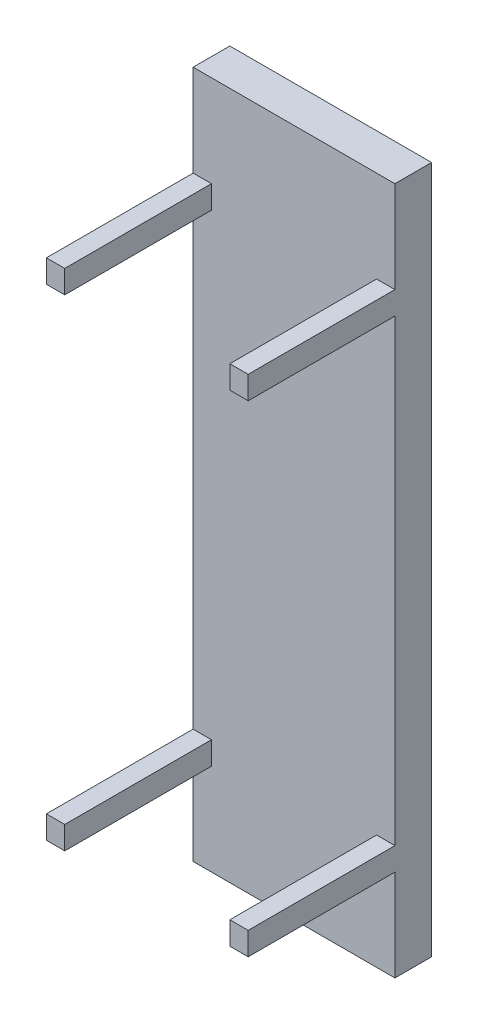
ISO-10303-21;
HEADER;
FILE_DESCRIPTION(('STEP AP214'),'2;1');
FILE_NAME('part.step','',(''),(''),'','','');
FILE_SCHEMA(('AUTOMOTIVE_DESIGN { 1 0 10303 214 1 1 1 1 }'));
ENDSEC;
DATA;
#1=APPLICATION_CONTEXT('core data for automotive mechanical design processes');
#2=APPLICATION_PROTOCOL_DEFINITION('international standard','automotive_design',2000,#1);
#3=PRODUCT_CONTEXT('',#1,'mechanical');
#4=PRODUCT('Part','Part','',(#3));
#5=PRODUCT_RELATED_PRODUCT_CATEGORY('part','',(#4));
#6=PRODUCT_DEFINITION_FORMATION('','',#4);
#7=PRODUCT_DEFINITION_CONTEXT('part definition',#1,'design');
#8=PRODUCT_DEFINITION('design','',#6,#7);
#9=PRODUCT_DEFINITION_SHAPE('','',#8);
#10=(LENGTH_UNIT() NAMED_UNIT(*) SI_UNIT(.MILLI.,.METRE.));
#11=(NAMED_UNIT(*) PLANE_ANGLE_UNIT() SI_UNIT($,.RADIAN.));
#12=(NAMED_UNIT(*) SI_UNIT($,.STERADIAN.) SOLID_ANGLE_UNIT());
#13=UNCERTAINTY_MEASURE_WITH_UNIT(LENGTH_MEASURE(1.E-05),#10,'distance_accuracy_value','');
#14=(GEOMETRIC_REPRESENTATION_CONTEXT(3) GLOBAL_UNCERTAINTY_ASSIGNED_CONTEXT((#13)) GLOBAL_UNIT_ASSIGNED_CONTEXT((#10,
#11,#12)) REPRESENTATION_CONTEXT('',''));
#15=CARTESIAN_POINT('',(0.,0.,0.));
#16=DIRECTION('',(0.,0.,1.));
#17=DIRECTION('',(1.,0.,0.));
#18=AXIS2_PLACEMENT_3D('',#15,#16,#17);
#19=CARTESIAN_POINT('',(0.,0.,80.));
#20=DIRECTION('',(0.,0.,1.));
#21=DIRECTION('',(1.,0.,0.));
#22=AXIS2_PLACEMENT_3D('',#19,#20,#21);
#23=PLANE('',#22);
#24=DIRECTION('',(0.,1.,0.));
#25=VECTOR('',#24,1.);
#26=CARTESIAN_POINT('',(220.,-750.,80.));
#27=LINE('',#26,#25);
#28=CARTESIAN_POINT('',(220.000000000001,-500.,80.));
#29=VERTEX_POINT('',#28);
#30=CARTESIAN_POINT('',(220.,500.,80.));
#31=VERTEX_POINT('',#30);
#32=EDGE_CURVE('E292',#29,#31,#27,.T.);
#33=ORIENTED_EDGE('',*,*,#32,.T.);
#34=DIRECTION('',(1.,0.,0.));
#35=VECTOR('',#34,1.);
#36=CARTESIAN_POINT('',(180.,500.,80.));
#37=LINE('',#36,#35);
#38=CARTESIAN_POINT('',(180.,500.,80.));
#39=VERTEX_POINT('',#38);
#40=EDGE_CURVE('E53',#39,#31,#37,.T.);
#41=ORIENTED_EDGE('',*,*,#40,.F.);
#42=DIRECTION('',(0.,-1.,0.));
#43=VECTOR('',#42,1.);
#44=CARTESIAN_POINT('',(180.,550.,80.));
#45=LINE('',#44,#43);
#46=CARTESIAN_POINT('',(180.,550.,80.));
#47=VERTEX_POINT('',#46);
#48=EDGE_CURVE('E48',#47,#39,#45,.T.);
#49=ORIENTED_EDGE('',*,*,#48,.F.);
#50=DIRECTION('',(-1.,0.,0.));
#51=VECTOR('',#50,1.);
#52=CARTESIAN_POINT('',(220.,550.,80.));
#53=LINE('',#52,#51);
#54=CARTESIAN_POINT('',(220.,550.,80.));
#55=VERTEX_POINT('',#54);
#56=EDGE_CURVE('E558',#55,#47,#53,.T.);
#57=ORIENTED_EDGE('',*,*,#56,.F.);
#58=CARTESIAN_POINT('',(220.,750.,80.));
#59=VERTEX_POINT('',#58);
#60=EDGE_CURVE('E288',#55,#59,#27,.T.);
#61=ORIENTED_EDGE('',*,*,#60,.T.);
#62=DIRECTION('',(-1.,0.,0.));
#63=VECTOR('',#62,1.);
#64=CARTESIAN_POINT('',(-220.,750.,80.));
#65=LINE('',#64,#63);
#66=CARTESIAN_POINT('',(-220.,750.,80.));
#67=VERTEX_POINT('',#66);
#68=EDGE_CURVE('E291',#59,#67,#65,.T.);
#69=ORIENTED_EDGE('',*,*,#68,.T.);
#70=DIRECTION('',(0.,-1.,0.));
#71=VECTOR('',#70,1.);
#72=CARTESIAN_POINT('',(-220.,750.,80.));
#73=LINE('',#72,#71);
#74=CARTESIAN_POINT('',(-220.,550.,80.));
#75=VERTEX_POINT('',#74);
#76=EDGE_CURVE('E282',#67,#75,#73,.T.);
#77=ORIENTED_EDGE('',*,*,#76,.T.);
#78=DIRECTION('',(-1.,0.,0.));
#79=VECTOR('',#78,1.);
#80=CARTESIAN_POINT('',(-220.,550.,80.));
#81=LINE('',#80,#79);
#82=CARTESIAN_POINT('',(-180.,550.,80.));
#83=VERTEX_POINT('',#82);
#84=EDGE_CURVE('E256',#83,#75,#81,.T.);
#85=ORIENTED_EDGE('',*,*,#84,.F.);
#86=DIRECTION('',(0.,1.,0.));
#87=VECTOR('',#86,1.);
#88=CARTESIAN_POINT('',(-180.,550.,80.));
#89=LINE('',#88,#87);
#90=CARTESIAN_POINT('',(-180.,500.,80.));
#91=VERTEX_POINT('',#90);
#92=EDGE_CURVE('E265',#91,#83,#89,.T.);
#93=ORIENTED_EDGE('',*,*,#92,.F.);
#94=DIRECTION('',(1.,0.,0.));
#95=VECTOR('',#94,1.);
#96=CARTESIAN_POINT('',(-180.,500.,80.));
#97=LINE('',#96,#95);
#98=CARTESIAN_POINT('',(-220.,500.,80.));
#99=VERTEX_POINT('',#98);
#100=EDGE_CURVE('E251',#99,#91,#97,.T.);
#101=ORIENTED_EDGE('',*,*,#100,.F.);
#102=CARTESIAN_POINT('',(-220.,-500.,80.));
#103=VERTEX_POINT('',#102);
#104=EDGE_CURVE('E285',#99,#103,#73,.T.);
#105=ORIENTED_EDGE('',*,*,#104,.T.);
#106=DIRECTION('',(-1.,0.,0.));
#107=VECTOR('',#106,1.);
#108=CARTESIAN_POINT('',(-180.,-500.,80.));
#109=LINE('',#108,#107);
#110=CARTESIAN_POINT('',(-180.,-500.,80.));
#111=VERTEX_POINT('',#110);
#112=EDGE_CURVE('E225',#111,#103,#109,.T.);
#113=ORIENTED_EDGE('',*,*,#112,.F.);
#114=DIRECTION('',(0.,1.,0.));
#115=VECTOR('',#114,1.);
#116=CARTESIAN_POINT('',(-180.,-550.,80.));
#117=LINE('',#116,#115);
#118=CARTESIAN_POINT('',(-180.,-550.,80.));
#119=VERTEX_POINT('',#118);
#120=EDGE_CURVE('E230',#119,#111,#117,.T.);
#121=ORIENTED_EDGE('',*,*,#120,.F.);
#122=DIRECTION('',(1.,0.,0.));
#123=VECTOR('',#122,1.);
#124=CARTESIAN_POINT('',(-220.,-550.,80.));
#125=LINE('',#124,#123);
#126=CARTESIAN_POINT('',(-220.,-550.,80.));
#127=VERTEX_POINT('',#126);
#128=EDGE_CURVE('E239',#127,#119,#125,.T.);
#129=ORIENTED_EDGE('',*,*,#128,.F.);
#130=CARTESIAN_POINT('',(-220.,-750.,80.));
#131=VERTEX_POINT('',#130);
#132=EDGE_CURVE('E286',#127,#131,#73,.T.);
#133=ORIENTED_EDGE('',*,*,#132,.T.);
#134=DIRECTION('',(1.,0.,0.));
#135=VECTOR('',#134,1.);
#136=CARTESIAN_POINT('',(-220.,-750.,80.));
#137=LINE('',#136,#135);
#138=CARTESIAN_POINT('',(220.,-750.,80.));
#139=VERTEX_POINT('',#138);
#140=EDGE_CURVE('E284',#131,#139,#137,.T.);
#141=ORIENTED_EDGE('',*,*,#140,.T.);
#142=CARTESIAN_POINT('',(220.,-550.,80.));
#143=VERTEX_POINT('',#142);
#144=EDGE_CURVE('E289',#139,#143,#27,.T.);
#145=ORIENTED_EDGE('',*,*,#144,.T.);
#146=DIRECTION('',(1.,0.,0.));
#147=VECTOR('',#146,1.);
#148=CARTESIAN_POINT('',(220.000000000001,-550.,80.));
#149=LINE('',#148,#147);
#150=CARTESIAN_POINT('',(180.000000000001,-550.,80.));
#151=VERTEX_POINT('',#150);
#152=EDGE_CURVE('E203',#151,#143,#149,.T.);
#153=ORIENTED_EDGE('',*,*,#152,.F.);
#154=DIRECTION('',(0.,-1.,0.));
#155=VECTOR('',#154,1.);
#156=CARTESIAN_POINT('',(180.000000000001,-550.,80.));
#157=LINE('',#156,#155);
#158=CARTESIAN_POINT('',(180.000000000001,-500.,80.));
#159=VERTEX_POINT('',#158);
#160=EDGE_CURVE('E193',#159,#151,#157,.T.);
#161=ORIENTED_EDGE('',*,*,#160,.F.);
#162=DIRECTION('',(-1.,0.,0.));
#163=VECTOR('',#162,1.);
#164=CARTESIAN_POINT('',(180.000000000001,-500.,80.));
#165=LINE('',#164,#163);
#166=EDGE_CURVE('E190',#29,#159,#165,.T.);
#167=ORIENTED_EDGE('',*,*,#166,.F.);
#168=EDGE_LOOP('',(#33,#41,#49,#57,#61,#69,#77,#85,#93,#101,#105,#113,#121,#129,#133,#141,#145,
#153,#161,#167));
#169=FACE_BOUND('',#168,.T.);
#170=ADVANCED_FACE('F33',(#169),#23,.T.);
#171=CARTESIAN_POINT('',(-220.,750.,80.));
#172=DIRECTION('',(1.,0.,0.));
#173=DIRECTION('',(0.,1.,0.));
#174=AXIS2_PLACEMENT_3D('',#171,#172,#173);
#175=PLANE('',#174);
#176=DIRECTION('',(0.,-1.,0.));
#177=VECTOR('',#176,1.);
#178=CARTESIAN_POINT('',(-220.,750.,0.));
#179=LINE('',#178,#177);
#180=CARTESIAN_POINT('',(-220.,750.,0.));
#181=VERTEX_POINT('',#180);
#182=CARTESIAN_POINT('',(-220.,-750.,0.));
#183=VERTEX_POINT('',#182);
#184=EDGE_CURVE('E281',#181,#183,#179,.T.);
#185=ORIENTED_EDGE('',*,*,#184,.T.);
#186=DIRECTION('',(0.,0.,-1.));
#187=VECTOR('',#186,1.);
#188=CARTESIAN_POINT('',(-220.,-750.,80.));
#189=LINE('',#188,#187);
#190=EDGE_CURVE('E11',#131,#183,#189,.T.);
#191=ORIENTED_EDGE('',*,*,#190,.F.);
#192=ORIENTED_EDGE('',*,*,#132,.F.);
#193=DIRECTION('',(0.,0.,-1.));
#194=VECTOR('',#193,1.);
#195=CARTESIAN_POINT('',(-220.,-550.,400.));
#196=LINE('',#195,#194);
#197=CARTESIAN_POINT('',(-220.,-550.,400.));
#198=VERTEX_POINT('',#197);
#199=EDGE_CURVE('E247',#198,#127,#196,.T.);
#200=ORIENTED_EDGE('',*,*,#199,.F.);
#201=DIRECTION('',(0.,-1.,0.));
#202=VECTOR('',#201,1.);
#203=CARTESIAN_POINT('',(-220.,-500.,400.));
#204=LINE('',#203,#202);
#205=CARTESIAN_POINT('',(-220.,-500.,400.));
#206=VERTEX_POINT('',#205);
#207=EDGE_CURVE('E229',#206,#198,#204,.T.);
#208=ORIENTED_EDGE('',*,*,#207,.F.);
#209=DIRECTION('',(0.,0.,-1.));
#210=VECTOR('',#209,1.);
#211=CARTESIAN_POINT('',(-220.,-500.,400.));
#212=LINE('',#211,#210);
#213=EDGE_CURVE('E249',#206,#103,#212,.T.);
#214=ORIENTED_EDGE('',*,*,#213,.T.);
#215=ORIENTED_EDGE('',*,*,#104,.F.);
#216=DIRECTION('',(0.,0.,-1.));
#217=VECTOR('',#216,1.);
#218=CARTESIAN_POINT('',(-220.,500.,400.));
#219=LINE('',#218,#217);
#220=CARTESIAN_POINT('',(-220.,500.,400.));
#221=VERTEX_POINT('',#220);
#222=EDGE_CURVE('E278',#221,#99,#219,.T.);
#223=ORIENTED_EDGE('',*,*,#222,.F.);
#224=DIRECTION('',(0.,-1.,0.));
#225=VECTOR('',#224,1.);
#226=CARTESIAN_POINT('',(-220.,500.,400.));
#227=LINE('',#226,#225);
#228=CARTESIAN_POINT('',(-220.,550.,400.));
#229=VERTEX_POINT('',#228);
#230=EDGE_CURVE('E252',#229,#221,#227,.T.);
#231=ORIENTED_EDGE('',*,*,#230,.F.);
#232=DIRECTION('',(0.,0.,-1.));
#233=VECTOR('',#232,1.);
#234=CARTESIAN_POINT('',(-220.,550.,400.));
#235=LINE('',#234,#233);
#236=EDGE_CURVE('E262',#229,#75,#235,.T.);
#237=ORIENTED_EDGE('',*,*,#236,.T.);
#238=ORIENTED_EDGE('',*,*,#76,.F.);
#239=DIRECTION('',(0.,0.,-1.));
#240=VECTOR('',#239,1.);
#241=CARTESIAN_POINT('',(-220.,750.,80.));
#242=LINE('',#241,#240);
#243=EDGE_CURVE('E294',#67,#181,#242,.T.);
#244=ORIENTED_EDGE('',*,*,#243,.T.);
#245=EDGE_LOOP('',(#185,#191,#192,#200,#208,#214,#215,#223,#231,#237,#238,#244));
#246=FACE_BOUND('',#245,.T.);
#247=ADVANCED_FACE('F35',(#246),#175,.F.);
#248=CARTESIAN_POINT('',(-220.,-750.,80.));
#249=DIRECTION('',(0.,1.,0.));
#250=DIRECTION('',(0.,0.,1.));
#251=AXIS2_PLACEMENT_3D('',#248,#249,#250);
#252=PLANE('',#251);
#253=DIRECTION('',(1.,0.,0.));
#254=VECTOR('',#253,1.);
#255=CARTESIAN_POINT('',(-220.,-750.,0.));
#256=LINE('',#255,#254);
#257=CARTESIAN_POINT('',(220.,-750.,0.));
#258=VERTEX_POINT('',#257);
#259=EDGE_CURVE('E297',#183,#258,#256,.T.);
#260=ORIENTED_EDGE('',*,*,#259,.T.);
#261=DIRECTION('',(0.,0.,-1.));
#262=VECTOR('',#261,1.);
#263=CARTESIAN_POINT('',(220.,-750.,80.));
#264=LINE('',#263,#262);
#265=EDGE_CURVE('E41',#139,#258,#264,.T.);
#266=ORIENTED_EDGE('',*,*,#265,.F.);
#267=ORIENTED_EDGE('',*,*,#140,.F.);
#268=ORIENTED_EDGE('',*,*,#190,.T.);
#269=EDGE_LOOP('',(#260,#266,#267,#268));
#270=FACE_BOUND('',#269,.T.);
#271=ADVANCED_FACE('F346',(#270),#252,.F.);
#272=CARTESIAN_POINT('',(220.,-750.,80.));
#273=DIRECTION('',(-1.,0.,0.));
#274=DIRECTION('',(0.,0.,1.));
#275=AXIS2_PLACEMENT_3D('',#272,#273,#274);
#276=PLANE('',#275);
#277=DIRECTION('',(0.,1.,0.));
#278=VECTOR('',#277,1.);
#279=CARTESIAN_POINT('',(220.,-750.,0.));
#280=LINE('',#279,#278);
#281=CARTESIAN_POINT('',(220.,750.,0.));
#282=VERTEX_POINT('',#281);
#283=EDGE_CURVE('E299',#258,#282,#280,.T.);
#284=ORIENTED_EDGE('',*,*,#283,.T.);
#285=DIRECTION('',(0.,0.,-1.));
#286=VECTOR('',#285,1.);
#287=CARTESIAN_POINT('',(220.,750.,80.));
#288=LINE('',#287,#286);
#289=EDGE_CURVE('E305',#59,#282,#288,.T.);
#290=ORIENTED_EDGE('',*,*,#289,.F.);
#291=ORIENTED_EDGE('',*,*,#60,.F.);
#292=DIRECTION('',(0.,0.,-1.));
#293=VECTOR('',#292,1.);
#294=CARTESIAN_POINT('',(220.,550.,400.));
#295=LINE('',#294,#293);
#296=CARTESIAN_POINT('',(220.,550.,400.));
#297=VERTEX_POINT('',#296);
#298=EDGE_CURVE('E175',#297,#55,#295,.T.);
#299=ORIENTED_EDGE('',*,*,#298,.F.);
#300=DIRECTION('',(0.,1.,0.));
#301=VECTOR('',#300,1.);
#302=CARTESIAN_POINT('',(220.,500.,400.));
#303=LINE('',#302,#301);
#304=CARTESIAN_POINT('',(220.,500.,400.));
#305=VERTEX_POINT('',#304);
#306=EDGE_CURVE('E169',#305,#297,#303,.T.);
#307=ORIENTED_EDGE('',*,*,#306,.F.);
#308=DIRECTION('',(0.,0.,-1.));
#309=VECTOR('',#308,1.);
#310=CARTESIAN_POINT('',(220.,500.,400.));
#311=LINE('',#310,#309);
#312=EDGE_CURVE('E173',#305,#31,#311,.T.);
#313=ORIENTED_EDGE('',*,*,#312,.T.);
#314=ORIENTED_EDGE('',*,*,#32,.F.);
#315=DIRECTION('',(0.,0.,-1.));
#316=VECTOR('',#315,1.);
#317=CARTESIAN_POINT('',(220.000000000001,-500.,400.));
#318=LINE('',#317,#316);
#319=CARTESIAN_POINT('',(220.000000000001,-500.,400.));
#320=VERTEX_POINT('',#319);
#321=EDGE_CURVE('E222',#320,#29,#318,.T.);
#322=ORIENTED_EDGE('',*,*,#321,.F.);
#323=DIRECTION('',(0.,1.,0.));
#324=VECTOR('',#323,1.);
#325=CARTESIAN_POINT('',(220.000000000001,-500.,400.));
#326=LINE('',#325,#324);
#327=CARTESIAN_POINT('',(220.000000000001,-550.,400.));
#328=VERTEX_POINT('',#327);
#329=EDGE_CURVE('E199',#328,#320,#326,.T.);
#330=ORIENTED_EDGE('',*,*,#329,.F.);
#331=DIRECTION('',(0.,0.,-1.));
#332=VECTOR('',#331,1.);
#333=CARTESIAN_POINT('',(220.000000000001,-550.,400.));
#334=LINE('',#333,#332);
#335=EDGE_CURVE('E208',#328,#143,#334,.T.);
#336=ORIENTED_EDGE('',*,*,#335,.T.);
#337=ORIENTED_EDGE('',*,*,#144,.F.);
#338=ORIENTED_EDGE('',*,*,#265,.T.);
#339=EDGE_LOOP('',(#284,#290,#291,#299,#307,#313,#314,#322,#330,#336,#337,#338));
#340=FACE_BOUND('',#339,.T.);
#341=ADVANCED_FACE('F171',(#340),#276,.F.);
#342=CARTESIAN_POINT('',(-220.,750.,80.));
#343=DIRECTION('',(0.,-1.,0.));
#344=DIRECTION('',(0.,0.,-1.));
#345=AXIS2_PLACEMENT_3D('',#342,#343,#344);
#346=PLANE('',#345);
#347=DIRECTION('',(-1.,0.,0.));
#348=VECTOR('',#347,1.);
#349=CARTESIAN_POINT('',(-220.,750.,0.));
#350=LINE('',#349,#348);
#351=EDGE_CURVE('E301',#282,#181,#350,.T.);
#352=ORIENTED_EDGE('',*,*,#351,.T.);
#353=ORIENTED_EDGE('',*,*,#243,.F.);
#354=ORIENTED_EDGE('',*,*,#68,.F.);
#355=ORIENTED_EDGE('',*,*,#289,.T.);
#356=EDGE_LOOP('',(#352,#353,#354,#355));
#357=FACE_BOUND('',#356,.T.);
#358=ADVANCED_FACE('F320',(#357),#346,.F.);
#359=CARTESIAN_POINT('',(0.,0.,0.));
#360=DIRECTION('',(0.,0.,1.));
#361=DIRECTION('',(1.,0.,0.));
#362=AXIS2_PLACEMENT_3D('',#359,#360,#361);
#363=PLANE('',#362);
#364=ORIENTED_EDGE('',*,*,#184,.F.);
#365=ORIENTED_EDGE('',*,*,#351,.F.);
#366=ORIENTED_EDGE('',*,*,#283,.F.);
#367=ORIENTED_EDGE('',*,*,#259,.F.);
#368=EDGE_LOOP('',(#364,#365,#366,#367));
#369=FACE_BOUND('',#368,.T.);
#370=ADVANCED_FACE('F317',(#369),#363,.F.);
#371=CARTESIAN_POINT('',(-180.,500.,400.));
#372=DIRECTION('',(0.,1.,0.));
#373=DIRECTION('',(0.,0.,1.));
#374=AXIS2_PLACEMENT_3D('',#371,#372,#373);
#375=PLANE('',#374);
#376=ORIENTED_EDGE('',*,*,#100,.T.);
#377=DIRECTION('',(0.,0.,-1.));
#378=VECTOR('',#377,1.);
#379=CARTESIAN_POINT('',(-180.,500.,400.));
#380=LINE('',#379,#378);
#381=CARTESIAN_POINT('',(-180.,500.,400.));
#382=VERTEX_POINT('',#381);
#383=EDGE_CURVE('E275',#382,#91,#380,.T.);
#384=ORIENTED_EDGE('',*,*,#383,.F.);
#385=DIRECTION('',(1.,0.,0.));
#386=VECTOR('',#385,1.);
#387=CARTESIAN_POINT('',(-180.,500.,400.));
#388=LINE('',#387,#386);
#389=EDGE_CURVE('E255',#221,#382,#388,.T.);
#390=ORIENTED_EDGE('',*,*,#389,.F.);
#391=ORIENTED_EDGE('',*,*,#222,.T.);
#392=EDGE_LOOP('',(#376,#384,#390,#391));
#393=FACE_BOUND('',#392,.T.);
#394=ADVANCED_FACE('F338',(#393),#375,.F.);
#395=CARTESIAN_POINT('',(-180.,550.,400.));
#396=DIRECTION('',(-1.,0.,0.));
#397=DIRECTION('',(0.,0.,1.));
#398=AXIS2_PLACEMENT_3D('',#395,#396,#397);
#399=PLANE('',#398);
#400=ORIENTED_EDGE('',*,*,#92,.T.);
#401=DIRECTION('',(0.,0.,-1.));
#402=VECTOR('',#401,1.);
#403=CARTESIAN_POINT('',(-180.,550.,400.));
#404=LINE('',#403,#402);
#405=CARTESIAN_POINT('',(-180.,550.,400.));
#406=VERTEX_POINT('',#405);
#407=EDGE_CURVE('E272',#406,#83,#404,.T.);
#408=ORIENTED_EDGE('',*,*,#407,.F.);
#409=DIRECTION('',(0.,1.,0.));
#410=VECTOR('',#409,1.);
#411=CARTESIAN_POINT('',(-180.,550.,400.));
#412=LINE('',#411,#410);
#413=EDGE_CURVE('E258',#382,#406,#412,.T.);
#414=ORIENTED_EDGE('',*,*,#413,.F.);
#415=ORIENTED_EDGE('',*,*,#383,.T.);
#416=EDGE_LOOP('',(#400,#408,#414,#415));
#417=FACE_BOUND('',#416,.T.);
#418=ADVANCED_FACE('F333',(#417),#399,.F.);
#419=CARTESIAN_POINT('',(-220.,550.,400.));
#420=DIRECTION('',(0.,-1.,0.));
#421=DIRECTION('',(0.,0.,-1.));
#422=AXIS2_PLACEMENT_3D('',#419,#420,#421);
#423=PLANE('',#422);
#424=ORIENTED_EDGE('',*,*,#84,.T.);
#425=ORIENTED_EDGE('',*,*,#236,.F.);
#426=DIRECTION('',(-1.,0.,0.));
#427=VECTOR('',#426,1.);
#428=CARTESIAN_POINT('',(-220.,550.,400.));
#429=LINE('',#428,#427);
#430=EDGE_CURVE('E260',#406,#229,#429,.T.);
#431=ORIENTED_EDGE('',*,*,#430,.F.);
#432=ORIENTED_EDGE('',*,*,#407,.T.);
#433=EDGE_LOOP('',(#424,#425,#431,#432));
#434=FACE_BOUND('',#433,.T.);
#435=ADVANCED_FACE('F328',(#434),#423,.F.);
#436=CARTESIAN_POINT('',(0.,0.,400.));
#437=DIRECTION('',(0.,0.,-1.));
#438=DIRECTION('',(-1.,0.,0.));
#439=AXIS2_PLACEMENT_3D('',#436,#437,#438);
#440=PLANE('',#439);
#441=ORIENTED_EDGE('',*,*,#230,.T.);
#442=ORIENTED_EDGE('',*,*,#389,.T.);
#443=ORIENTED_EDGE('',*,*,#413,.T.);
#444=ORIENTED_EDGE('',*,*,#430,.T.);
#445=EDGE_LOOP('',(#441,#442,#443,#444));
#446=FACE_BOUND('',#445,.T.);
#447=ADVANCED_FACE('F387',(#446),#440,.F.);
#448=CARTESIAN_POINT('',(-180.,-500.,400.));
#449=DIRECTION('',(0.,-1.,0.));
#450=DIRECTION('',(0.,0.,-1.));
#451=AXIS2_PLACEMENT_3D('',#448,#449,#450);
#452=PLANE('',#451);
#453=ORIENTED_EDGE('',*,*,#112,.T.);
#454=ORIENTED_EDGE('',*,*,#213,.F.);
#455=DIRECTION('',(-1.,0.,0.));
#456=VECTOR('',#455,1.);
#457=CARTESIAN_POINT('',(-180.,-500.,400.));
#458=LINE('',#457,#456);
#459=CARTESIAN_POINT('',(-180.,-500.,400.));
#460=VERTEX_POINT('',#459);
#461=EDGE_CURVE('E226',#460,#206,#458,.T.);
#462=ORIENTED_EDGE('',*,*,#461,.F.);
#463=DIRECTION('',(0.,0.,-1.));
#464=VECTOR('',#463,1.);
#465=CARTESIAN_POINT('',(-180.,-500.,400.));
#466=LINE('',#465,#464);
#467=EDGE_CURVE('E236',#460,#111,#466,.T.);
#468=ORIENTED_EDGE('',*,*,#467,.T.);
#469=EDGE_LOOP('',(#453,#454,#462,#468));
#470=FACE_BOUND('',#469,.T.);
#471=ADVANCED_FACE('F394',(#470),#452,.F.);
#472=CARTESIAN_POINT('',(-220.,-550.,400.));
#473=DIRECTION('',(0.,1.,0.));
#474=DIRECTION('',(0.,0.,1.));
#475=AXIS2_PLACEMENT_3D('',#472,#473,#474);
#476=PLANE('',#475);
#477=ORIENTED_EDGE('',*,*,#128,.T.);
#478=DIRECTION('',(0.,0.,-1.));
#479=VECTOR('',#478,1.);
#480=CARTESIAN_POINT('',(-180.,-550.,400.));
#481=LINE('',#480,#479);
#482=CARTESIAN_POINT('',(-180.,-550.,400.));
#483=VERTEX_POINT('',#482);
#484=EDGE_CURVE('E245',#483,#119,#481,.T.);
#485=ORIENTED_EDGE('',*,*,#484,.F.);
#486=DIRECTION('',(1.,0.,0.));
#487=VECTOR('',#486,1.);
#488=CARTESIAN_POINT('',(-220.,-550.,400.));
#489=LINE('',#488,#487);
#490=EDGE_CURVE('E232',#198,#483,#489,.T.);
#491=ORIENTED_EDGE('',*,*,#490,.F.);
#492=ORIENTED_EDGE('',*,*,#199,.T.);
#493=EDGE_LOOP('',(#477,#485,#491,#492));
#494=FACE_BOUND('',#493,.T.);
#495=ADVANCED_FACE('F402',(#494),#476,.F.);
#496=CARTESIAN_POINT('',(-180.,-550.,400.));
#497=DIRECTION('',(-1.,0.,0.));
#498=DIRECTION('',(0.,-1.,0.));
#499=AXIS2_PLACEMENT_3D('',#496,#497,#498);
#500=PLANE('',#499);
#501=ORIENTED_EDGE('',*,*,#120,.T.);
#502=ORIENTED_EDGE('',*,*,#467,.F.);
#503=DIRECTION('',(0.,1.,0.));
#504=VECTOR('',#503,1.);
#505=CARTESIAN_POINT('',(-180.,-550.,400.));
#506=LINE('',#505,#504);
#507=EDGE_CURVE('E234',#483,#460,#506,.T.);
#508=ORIENTED_EDGE('',*,*,#507,.F.);
#509=ORIENTED_EDGE('',*,*,#484,.T.);
#510=EDGE_LOOP('',(#501,#502,#508,#509));
#511=FACE_BOUND('',#510,.T.);
#512=ADVANCED_FACE('F410',(#511),#500,.F.);
#513=CARTESIAN_POINT('',(0.,0.,400.));
#514=DIRECTION('',(0.,0.,1.));
#515=DIRECTION('',(1.,0.,0.));
#516=AXIS2_PLACEMENT_3D('',#513,#514,#515);
#517=PLANE('',#516);
#518=ORIENTED_EDGE('',*,*,#461,.T.);
#519=ORIENTED_EDGE('',*,*,#207,.T.);
#520=ORIENTED_EDGE('',*,*,#490,.T.);
#521=ORIENTED_EDGE('',*,*,#507,.T.);
#522=EDGE_LOOP('',(#518,#519,#520,#521));
#523=FACE_BOUND('',#522,.T.);
#524=ADVANCED_FACE('F418',(#523),#517,.T.);
#525=CARTESIAN_POINT('',(180.000000000001,-500.,400.));
#526=DIRECTION('',(0.,-1.,0.));
#527=DIRECTION('',(0.,0.,-1.));
#528=AXIS2_PLACEMENT_3D('',#525,#526,#527);
#529=PLANE('',#528);
#530=ORIENTED_EDGE('',*,*,#166,.T.);
#531=DIRECTION('',(0.,0.,-1.));
#532=VECTOR('',#531,1.);
#533=CARTESIAN_POINT('',(180.000000000001,-500.,400.));
#534=LINE('',#533,#532);
#535=CARTESIAN_POINT('',(180.000000000001,-500.,400.));
#536=VERTEX_POINT('',#535);
#537=EDGE_CURVE('E219',#536,#159,#534,.T.);
#538=ORIENTED_EDGE('',*,*,#537,.F.);
#539=DIRECTION('',(-1.,0.,0.));
#540=VECTOR('',#539,1.);
#541=CARTESIAN_POINT('',(180.000000000001,-500.,400.));
#542=LINE('',#541,#540);
#543=EDGE_CURVE('E202',#320,#536,#542,.T.);
#544=ORIENTED_EDGE('',*,*,#543,.F.);
#545=ORIENTED_EDGE('',*,*,#321,.T.);
#546=EDGE_LOOP('',(#530,#538,#544,#545));
#547=FACE_BOUND('',#546,.T.);
#548=ADVANCED_FACE('F426',(#547),#529,.F.);
#549=CARTESIAN_POINT('',(180.000000000001,-550.,400.));
#550=DIRECTION('',(1.,0.,0.));
#551=DIRECTION('',(0.,1.,0.));
#552=AXIS2_PLACEMENT_3D('',#549,#550,#551);
#553=PLANE('',#552);
#554=ORIENTED_EDGE('',*,*,#160,.T.);
#555=DIRECTION('',(0.,0.,-1.));
#556=VECTOR('',#555,1.);
#557=CARTESIAN_POINT('',(180.000000000001,-550.,400.));
#558=LINE('',#557,#556);
#559=CARTESIAN_POINT('',(180.000000000001,-550.,400.));
#560=VERTEX_POINT('',#559);
#561=EDGE_CURVE('E216',#560,#151,#558,.T.);
#562=ORIENTED_EDGE('',*,*,#561,.F.);
#563=DIRECTION('',(0.,-1.,0.));
#564=VECTOR('',#563,1.);
#565=CARTESIAN_POINT('',(180.000000000001,-550.,400.));
#566=LINE('',#565,#564);
#567=EDGE_CURVE('E205',#536,#560,#566,.T.);
#568=ORIENTED_EDGE('',*,*,#567,.F.);
#569=ORIENTED_EDGE('',*,*,#537,.T.);
#570=EDGE_LOOP('',(#554,#562,#568,#569));
#571=FACE_BOUND('',#570,.T.);
#572=ADVANCED_FACE('F434',(#571),#553,.F.);
#573=CARTESIAN_POINT('',(220.000000000001,-550.,400.));
#574=DIRECTION('',(0.,1.,0.));
#575=DIRECTION('',(0.,0.,1.));
#576=AXIS2_PLACEMENT_3D('',#573,#574,#575);
#577=PLANE('',#576);
#578=ORIENTED_EDGE('',*,*,#152,.T.);
#579=ORIENTED_EDGE('',*,*,#335,.F.);
#580=DIRECTION('',(1.,0.,0.));
#581=VECTOR('',#580,1.);
#582=CARTESIAN_POINT('',(220.000000000001,-550.,400.));
#583=LINE('',#582,#581);
#584=EDGE_CURVE('E207',#560,#328,#583,.T.);
#585=ORIENTED_EDGE('',*,*,#584,.F.);
#586=ORIENTED_EDGE('',*,*,#561,.T.);
#587=EDGE_LOOP('',(#578,#579,#585,#586));
#588=FACE_BOUND('',#587,.T.);
#589=ADVANCED_FACE('F442',(#588),#577,.F.);
#590=CARTESIAN_POINT('',(0.,0.,400.));
#591=DIRECTION('',(0.,0.,-1.));
#592=DIRECTION('',(-1.,0.,0.));
#593=AXIS2_PLACEMENT_3D('',#590,#591,#592);
#594=PLANE('',#593);
#595=ORIENTED_EDGE('',*,*,#329,.T.);
#596=ORIENTED_EDGE('',*,*,#543,.T.);
#597=ORIENTED_EDGE('',*,*,#567,.T.);
#598=ORIENTED_EDGE('',*,*,#584,.T.);
#599=EDGE_LOOP('',(#595,#596,#597,#598));
#600=FACE_BOUND('',#599,.T.);
#601=ADVANCED_FACE('F450',(#600),#594,.F.);
#602=CARTESIAN_POINT('',(180.,500.,400.));
#603=DIRECTION('',(0.,1.,0.));
#604=DIRECTION('',(0.,0.,1.));
#605=AXIS2_PLACEMENT_3D('',#602,#603,#604);
#606=PLANE('',#605);
#607=ORIENTED_EDGE('',*,*,#40,.T.);
#608=ORIENTED_EDGE('',*,*,#312,.F.);
#609=DIRECTION('',(1.,0.,0.));
#610=VECTOR('',#609,1.);
#611=CARTESIAN_POINT('',(180.,500.,400.));
#612=LINE('',#611,#610);
#613=CARTESIAN_POINT('',(180.,500.,400.));
#614=VERTEX_POINT('',#613);
#615=EDGE_CURVE('E179',#614,#305,#612,.T.);
#616=ORIENTED_EDGE('',*,*,#615,.F.);
#617=DIRECTION('',(0.,0.,-1.));
#618=VECTOR('',#617,1.);
#619=CARTESIAN_POINT('',(180.,500.,400.));
#620=LINE('',#619,#618);
#621=EDGE_CURVE('E556',#614,#39,#620,.T.);
#622=ORIENTED_EDGE('',*,*,#621,.T.);
#623=EDGE_LOOP('',(#607,#608,#616,#622));
#624=FACE_BOUND('',#623,.T.);
#625=ADVANCED_FACE('F189',(#624),#606,.F.);
#626=CARTESIAN_POINT('',(220.,550.,400.));
#627=DIRECTION('',(0.,-1.,0.));
#628=DIRECTION('',(0.,0.,-1.));
#629=AXIS2_PLACEMENT_3D('',#626,#627,#628);
#630=PLANE('',#629);
#631=ORIENTED_EDGE('',*,*,#56,.T.);
#632=DIRECTION('',(0.,0.,-1.));
#633=VECTOR('',#632,1.);
#634=CARTESIAN_POINT('',(180.,550.,400.));
#635=LINE('',#634,#633);
#636=CARTESIAN_POINT('',(180.,550.,400.));
#637=VERTEX_POINT('',#636);
#638=EDGE_CURVE('E195',#637,#47,#635,.T.);
#639=ORIENTED_EDGE('',*,*,#638,.F.);
#640=DIRECTION('',(-1.,0.,0.));
#641=VECTOR('',#640,1.);
#642=CARTESIAN_POINT('',(220.,550.,400.));
#643=LINE('',#642,#641);
#644=EDGE_CURVE('E178',#297,#637,#643,.T.);
#645=ORIENTED_EDGE('',*,*,#644,.F.);
#646=ORIENTED_EDGE('',*,*,#298,.T.);
#647=EDGE_LOOP('',(#631,#639,#645,#646));
#648=FACE_BOUND('',#647,.T.);
#649=ADVANCED_FACE('F465',(#648),#630,.F.);
#650=CARTESIAN_POINT('',(180.,550.,400.));
#651=DIRECTION('',(1.,0.,0.));
#652=DIRECTION('',(0.,1.,0.));
#653=AXIS2_PLACEMENT_3D('',#650,#651,#652);
#654=PLANE('',#653);
#655=ORIENTED_EDGE('',*,*,#48,.T.);
#656=ORIENTED_EDGE('',*,*,#621,.F.);
#657=DIRECTION('',(0.,-1.,0.));
#658=VECTOR('',#657,1.);
#659=CARTESIAN_POINT('',(180.,550.,400.));
#660=LINE('',#659,#658);
#661=EDGE_CURVE('E184',#637,#614,#660,.T.);
#662=ORIENTED_EDGE('',*,*,#661,.F.);
#663=ORIENTED_EDGE('',*,*,#638,.T.);
#664=EDGE_LOOP('',(#655,#656,#662,#663));
#665=FACE_BOUND('',#664,.T.);
#666=ADVANCED_FACE('F472',(#665),#654,.F.);
#667=CARTESIAN_POINT('',(0.,0.,400.));
#668=DIRECTION('',(0.,0.,1.));
#669=DIRECTION('',(1.,0.,0.));
#670=AXIS2_PLACEMENT_3D('',#667,#668,#669);
#671=PLANE('',#670);
#672=ORIENTED_EDGE('',*,*,#615,.T.);
#673=ORIENTED_EDGE('',*,*,#306,.T.);
#674=ORIENTED_EDGE('',*,*,#644,.T.);
#675=ORIENTED_EDGE('',*,*,#661,.T.);
#676=EDGE_LOOP('',(#672,#673,#674,#675));
#677=FACE_BOUND('',#676,.T.);
#678=ADVANCED_FACE('F182',(#677),#671,.T.);
#679=CLOSED_SHELL('',(#170,#247,#271,#341,#358,#370,#394,#418,#435,#447,#471,#495,#512,#524,
#548,#572,#589,#601,#625,#649,#666,#678));
#680=MANIFOLD_SOLID_BREP('B2',#679);
#681=ADVANCED_BREP_SHAPE_REPRESENTATION('',(#18,#680),#14);
#682=SHAPE_DEFINITION_REPRESENTATION(#9,#681);
ENDSEC;
END-ISO-10303-21;
